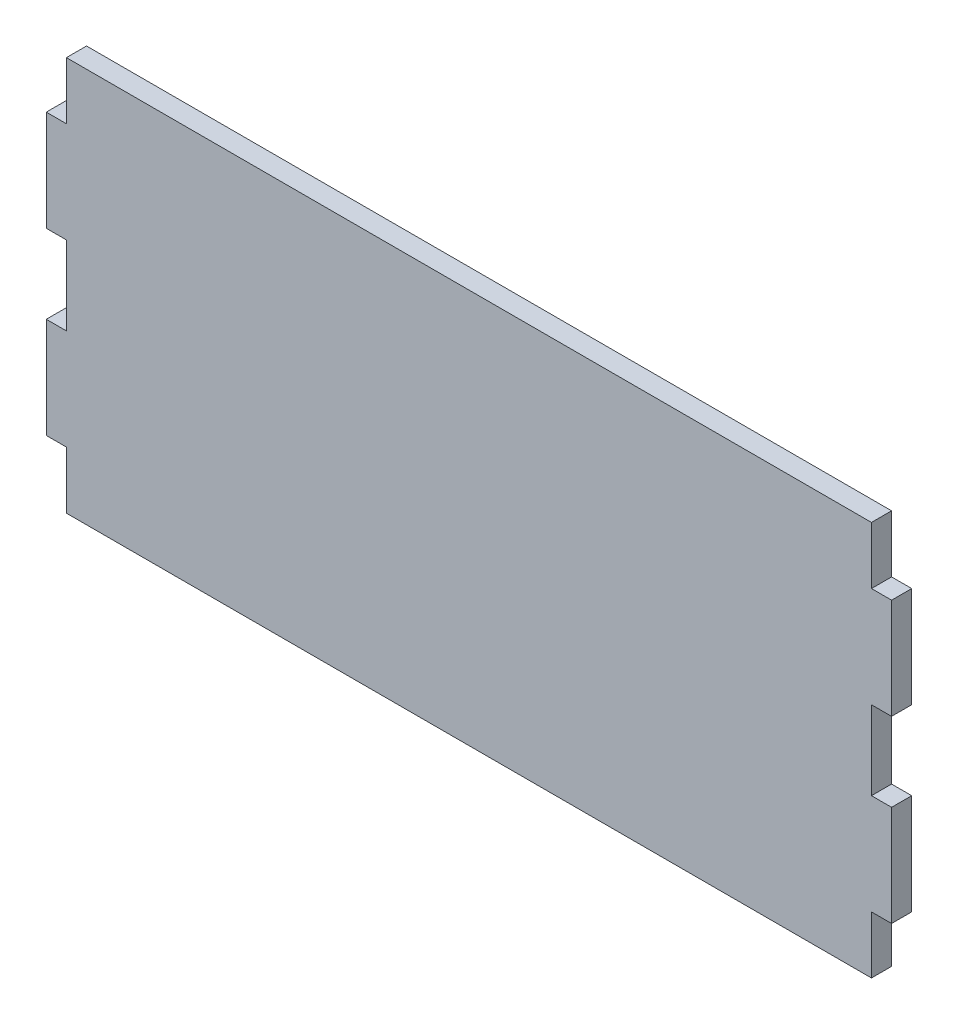
ISO-10303-21;
HEADER;
FILE_DESCRIPTION(('STEP AP214'),'2;1');
FILE_NAME('part.step','',(''),(''),'','','');
FILE_SCHEMA(('AUTOMOTIVE_DESIGN { 1 0 10303 214 1 1 1 1 }'));
ENDSEC;
DATA;
#1=APPLICATION_CONTEXT('core data for automotive mechanical design processes');
#2=APPLICATION_PROTOCOL_DEFINITION('international standard','automotive_design',2000,#1);
#3=PRODUCT_CONTEXT('',#1,'mechanical');
#4=PRODUCT('Part','Part','',(#3));
#5=PRODUCT_RELATED_PRODUCT_CATEGORY('part','',(#4));
#6=PRODUCT_DEFINITION_FORMATION('','',#4);
#7=PRODUCT_DEFINITION_CONTEXT('part definition',#1,'design');
#8=PRODUCT_DEFINITION('design','',#6,#7);
#9=PRODUCT_DEFINITION_SHAPE('','',#8);
#10=(LENGTH_UNIT() NAMED_UNIT(*) SI_UNIT(.MILLI.,.METRE.));
#11=(NAMED_UNIT(*) PLANE_ANGLE_UNIT() SI_UNIT($,.RADIAN.));
#12=(NAMED_UNIT(*) SI_UNIT($,.STERADIAN.) SOLID_ANGLE_UNIT());
#13=UNCERTAINTY_MEASURE_WITH_UNIT(LENGTH_MEASURE(1.E-05),#10,'distance_accuracy_value','');
#14=(GEOMETRIC_REPRESENTATION_CONTEXT(3) GLOBAL_UNCERTAINTY_ASSIGNED_CONTEXT((#13)) GLOBAL_UNIT_ASSIGNED_CONTEXT((#10,
#11,#12)) REPRESENTATION_CONTEXT('',''));
#15=CARTESIAN_POINT('',(0.,0.,0.));
#16=DIRECTION('',(0.,0.,1.));
#17=DIRECTION('',(1.,0.,0.));
#18=AXIS2_PLACEMENT_3D('',#15,#16,#17);
#19=CARTESIAN_POINT('',(0.,0.,15.));
#20=DIRECTION('',(1.,0.,0.));
#21=DIRECTION('',(0.,0.,-1.));
#22=AXIS2_PLACEMENT_3D('',#19,#20,#21);
#23=PLANE('',#22);
#24=DIRECTION('',(0.,-1.,0.));
#25=VECTOR('',#24,1.);
#26=CARTESIAN_POINT('',(0.,0.,0.));
#27=LINE('',#26,#25);
#28=CARTESIAN_POINT('',(0.,42.675,0.));
#29=VERTEX_POINT('',#28);
#30=CARTESIAN_POINT('',(0.,0.,0.));
#31=VERTEX_POINT('',#30);
#32=EDGE_CURVE('E204',#29,#31,#27,.T.);
#33=ORIENTED_EDGE('',*,*,#32,.T.);
#34=DIRECTION('',(0.,0.,-1.));
#35=VECTOR('',#34,1.);
#36=CARTESIAN_POINT('',(0.,0.,15.));
#37=LINE('',#36,#35);
#38=CARTESIAN_POINT('',(0.,0.,15.));
#39=VERTEX_POINT('',#38);
#40=EDGE_CURVE('E11',#39,#31,#37,.T.);
#41=ORIENTED_EDGE('',*,*,#40,.F.);
#42=DIRECTION('',(0.,-1.,0.));
#43=VECTOR('',#42,1.);
#44=CARTESIAN_POINT('',(0.,0.,15.));
#45=LINE('',#44,#43);
#46=CARTESIAN_POINT('',(0.,42.675,15.));
#47=VERTEX_POINT('',#46);
#48=EDGE_CURVE('E242',#47,#39,#45,.T.);
#49=ORIENTED_EDGE('',*,*,#48,.F.);
#50=DIRECTION('',(0.,0.,-1.));
#51=VECTOR('',#50,1.);
#52=CARTESIAN_POINT('',(0.,42.675,15.));
#53=LINE('',#52,#51);
#54=EDGE_CURVE('E200',#47,#29,#53,.T.);
#55=ORIENTED_EDGE('',*,*,#54,.T.);
#56=EDGE_LOOP('',(#33,#41,#49,#55));
#57=FACE_BOUND('',#56,.T.);
#58=ADVANCED_FACE('F36',(#57),#23,.F.);
#59=CARTESIAN_POINT('',(0.,0.,15.));
#60=DIRECTION('',(0.,1.,0.));
#61=DIRECTION('',(0.,0.,1.));
#62=AXIS2_PLACEMENT_3D('',#59,#60,#61);
#63=PLANE('',#62);
#64=DIRECTION('',(1.,0.,0.));
#65=VECTOR('',#64,1.);
#66=CARTESIAN_POINT('',(0.,0.,0.));
#67=LINE('',#66,#65);
#68=CARTESIAN_POINT('',(600.,0.,0.));
#69=VERTEX_POINT('',#68);
#70=EDGE_CURVE('E207',#31,#69,#67,.T.);
#71=ORIENTED_EDGE('',*,*,#70,.T.);
#72=DIRECTION('',(0.,0.,-1.));
#73=VECTOR('',#72,1.);
#74=CARTESIAN_POINT('',(600.,0.,15.));
#75=LINE('',#74,#73);
#76=CARTESIAN_POINT('',(600.,0.,15.));
#77=VERTEX_POINT('',#76);
#78=EDGE_CURVE('E44',#77,#69,#75,.T.);
#79=ORIENTED_EDGE('',*,*,#78,.F.);
#80=DIRECTION('',(1.,0.,0.));
#81=VECTOR('',#80,1.);
#82=CARTESIAN_POINT('',(0.,0.,15.));
#83=LINE('',#82,#81);
#84=EDGE_CURVE('E131',#39,#77,#83,.T.);
#85=ORIENTED_EDGE('',*,*,#84,.F.);
#86=ORIENTED_EDGE('',*,*,#40,.T.);
#87=EDGE_LOOP('',(#71,#79,#85,#86));
#88=FACE_BOUND('',#87,.T.);
#89=ADVANCED_FACE('F360',(#88),#63,.F.);
#90=CARTESIAN_POINT('',(600.,0.,15.));
#91=DIRECTION('',(-1.,0.,0.));
#92=DIRECTION('',(0.,0.,1.));
#93=AXIS2_PLACEMENT_3D('',#90,#91,#92);
#94=PLANE('',#93);
#95=DIRECTION('',(0.,1.,0.));
#96=VECTOR('',#95,1.);
#97=CARTESIAN_POINT('',(600.,0.,0.));
#98=LINE('',#97,#96);
#99=CARTESIAN_POINT('',(600.,42.675,0.));
#100=VERTEX_POINT('',#99);
#101=EDGE_CURVE('E209',#69,#100,#98,.T.);
#102=ORIENTED_EDGE('',*,*,#101,.T.);
#103=DIRECTION('',(0.,0.,-1.));
#104=VECTOR('',#103,1.);
#105=CARTESIAN_POINT('',(600.,42.675,15.));
#106=LINE('',#105,#104);
#107=CARTESIAN_POINT('',(600.,42.675,15.));
#108=VERTEX_POINT('',#107);
#109=EDGE_CURVE('E285',#108,#100,#106,.T.);
#110=ORIENTED_EDGE('',*,*,#109,.F.);
#111=DIRECTION('',(0.,1.,0.));
#112=VECTOR('',#111,1.);
#113=CARTESIAN_POINT('',(600.,0.,15.));
#114=LINE('',#113,#112);
#115=EDGE_CURVE('E293',#77,#108,#114,.T.);
#116=ORIENTED_EDGE('',*,*,#115,.F.);
#117=ORIENTED_EDGE('',*,*,#78,.T.);
#118=EDGE_LOOP('',(#102,#110,#116,#117));
#119=FACE_BOUND('',#118,.T.);
#120=ADVANCED_FACE('F291',(#119),#94,.F.);
#121=CARTESIAN_POINT('',(600.,42.675,15.));
#122=DIRECTION('',(0.,1.,0.));
#123=DIRECTION('',(0.,0.,1.));
#124=AXIS2_PLACEMENT_3D('',#121,#122,#123);
#125=PLANE('',#124);
#126=DIRECTION('',(1.,0.,0.));
#127=VECTOR('',#126,1.);
#128=CARTESIAN_POINT('',(600.,42.675,0.));
#129=LINE('',#128,#127);
#130=CARTESIAN_POINT('',(615.,42.675,0.));
#131=VERTEX_POINT('',#130);
#132=EDGE_CURVE('E211',#100,#131,#129,.T.);
#133=ORIENTED_EDGE('',*,*,#132,.T.);
#134=DIRECTION('',(0.,0.,-1.));
#135=VECTOR('',#134,1.);
#136=CARTESIAN_POINT('',(615.,42.675,15.));
#137=LINE('',#136,#135);
#138=CARTESIAN_POINT('',(615.,42.675,15.));
#139=VERTEX_POINT('',#138);
#140=EDGE_CURVE('E282',#139,#131,#137,.T.);
#141=ORIENTED_EDGE('',*,*,#140,.F.);
#142=DIRECTION('',(1.,0.,0.));
#143=VECTOR('',#142,1.);
#144=CARTESIAN_POINT('',(600.,42.675,15.));
#145=LINE('',#144,#143);
#146=EDGE_CURVE('E311',#108,#139,#145,.T.);
#147=ORIENTED_EDGE('',*,*,#146,.F.);
#148=ORIENTED_EDGE('',*,*,#109,.T.);
#149=EDGE_LOOP('',(#133,#141,#147,#148));
#150=FACE_BOUND('',#149,.T.);
#151=ADVANCED_FACE('F302',(#150),#125,.F.);
#152=CARTESIAN_POINT('',(615.,42.675,15.));
#153=DIRECTION('',(-1.,0.,0.));
#154=DIRECTION('',(0.,-1.,0.));
#155=AXIS2_PLACEMENT_3D('',#152,#153,#154);
#156=PLANE('',#155);
#157=DIRECTION('',(0.,1.,0.));
#158=VECTOR('',#157,1.);
#159=CARTESIAN_POINT('',(615.,42.675,0.));
#160=LINE('',#159,#158);
#161=CARTESIAN_POINT('',(615.,117.675,0.));
#162=VERTEX_POINT('',#161);
#163=EDGE_CURVE('E213',#131,#162,#160,.T.);
#164=ORIENTED_EDGE('',*,*,#163,.T.);
#165=DIRECTION('',(0.,0.,-1.));
#166=VECTOR('',#165,1.);
#167=CARTESIAN_POINT('',(615.,117.675,15.));
#168=LINE('',#167,#166);
#169=CARTESIAN_POINT('',(615.,117.675,15.));
#170=VERTEX_POINT('',#169);
#171=EDGE_CURVE('E279',#170,#162,#168,.T.);
#172=ORIENTED_EDGE('',*,*,#171,.F.);
#173=DIRECTION('',(0.,1.,0.));
#174=VECTOR('',#173,1.);
#175=CARTESIAN_POINT('',(615.,42.675,15.));
#176=LINE('',#175,#174);
#177=EDGE_CURVE('E308',#139,#170,#176,.T.);
#178=ORIENTED_EDGE('',*,*,#177,.F.);
#179=ORIENTED_EDGE('',*,*,#140,.T.);
#180=EDGE_LOOP('',(#164,#172,#178,#179));
#181=FACE_BOUND('',#180,.T.);
#182=ADVANCED_FACE('F306',(#181),#156,.F.);
#183=CARTESIAN_POINT('',(615.,117.675,15.));
#184=DIRECTION('',(0.,-1.,0.));
#185=DIRECTION('',(0.,0.,-1.));
#186=AXIS2_PLACEMENT_3D('',#183,#184,#185);
#187=PLANE('',#186);
#188=DIRECTION('',(-1.,0.,0.));
#189=VECTOR('',#188,1.);
#190=CARTESIAN_POINT('',(615.,117.675,0.));
#191=LINE('',#190,#189);
#192=CARTESIAN_POINT('',(600.,117.675,0.));
#193=VERTEX_POINT('',#192);
#194=EDGE_CURVE('E215',#162,#193,#191,.T.);
#195=ORIENTED_EDGE('',*,*,#194,.T.);
#196=DIRECTION('',(0.,0.,-1.));
#197=VECTOR('',#196,1.);
#198=CARTESIAN_POINT('',(600.,117.675,15.));
#199=LINE('',#198,#197);
#200=CARTESIAN_POINT('',(600.,117.675,15.));
#201=VERTEX_POINT('',#200);
#202=EDGE_CURVE('E276',#201,#193,#199,.T.);
#203=ORIENTED_EDGE('',*,*,#202,.F.);
#204=DIRECTION('',(-1.,0.,0.));
#205=VECTOR('',#204,1.);
#206=CARTESIAN_POINT('',(615.,117.675,15.));
#207=LINE('',#206,#205);
#208=EDGE_CURVE('E310',#170,#201,#207,.T.);
#209=ORIENTED_EDGE('',*,*,#208,.F.);
#210=ORIENTED_EDGE('',*,*,#171,.T.);
#211=EDGE_LOOP('',(#195,#203,#209,#210));
#212=FACE_BOUND('',#211,.T.);
#213=ADVANCED_FACE('F373',(#212),#187,.F.);
#214=CARTESIAN_POINT('',(600.,117.675,15.));
#215=DIRECTION('',(-1.,0.,0.));
#216=DIRECTION('',(0.,0.,1.));
#217=AXIS2_PLACEMENT_3D('',#214,#215,#216);
#218=PLANE('',#217);
#219=DIRECTION('',(0.,1.,0.));
#220=VECTOR('',#219,1.);
#221=CARTESIAN_POINT('',(600.,117.675,0.));
#222=LINE('',#221,#220);
#223=CARTESIAN_POINT('',(600.,176.375,0.));
#224=VERTEX_POINT('',#223);
#225=EDGE_CURVE('E217',#193,#224,#222,.T.);
#226=ORIENTED_EDGE('',*,*,#225,.T.);
#227=DIRECTION('',(0.,0.,-1.));
#228=VECTOR('',#227,1.);
#229=CARTESIAN_POINT('',(600.,176.375,15.));
#230=LINE('',#229,#228);
#231=CARTESIAN_POINT('',(600.,176.375,15.));
#232=VERTEX_POINT('',#231);
#233=EDGE_CURVE('E273',#232,#224,#230,.T.);
#234=ORIENTED_EDGE('',*,*,#233,.F.);
#235=DIRECTION('',(0.,1.,0.));
#236=VECTOR('',#235,1.);
#237=CARTESIAN_POINT('',(600.,117.675,15.));
#238=LINE('',#237,#236);
#239=EDGE_CURVE('E313',#201,#232,#238,.T.);
#240=ORIENTED_EDGE('',*,*,#239,.F.);
#241=ORIENTED_EDGE('',*,*,#202,.T.);
#242=EDGE_LOOP('',(#226,#234,#240,#241));
#243=FACE_BOUND('',#242,.T.);
#244=ADVANCED_FACE('F376',(#243),#218,.F.);
#245=CARTESIAN_POINT('',(600.,176.375,15.));
#246=DIRECTION('',(0.,1.,0.));
#247=DIRECTION('',(0.,0.,1.));
#248=AXIS2_PLACEMENT_3D('',#245,#246,#247);
#249=PLANE('',#248);
#250=DIRECTION('',(1.,0.,0.));
#251=VECTOR('',#250,1.);
#252=CARTESIAN_POINT('',(600.,176.375,0.));
#253=LINE('',#252,#251);
#254=CARTESIAN_POINT('',(615.,176.375,0.));
#255=VERTEX_POINT('',#254);
#256=EDGE_CURVE('E219',#224,#255,#253,.T.);
#257=ORIENTED_EDGE('',*,*,#256,.T.);
#258=DIRECTION('',(0.,0.,-1.));
#259=VECTOR('',#258,1.);
#260=CARTESIAN_POINT('',(615.,176.375,15.));
#261=LINE('',#260,#259);
#262=CARTESIAN_POINT('',(615.,176.375,15.));
#263=VERTEX_POINT('',#262);
#264=EDGE_CURVE('E270',#263,#255,#261,.T.);
#265=ORIENTED_EDGE('',*,*,#264,.F.);
#266=DIRECTION('',(1.,0.,0.));
#267=VECTOR('',#266,1.);
#268=CARTESIAN_POINT('',(600.,176.375,15.));
#269=LINE('',#268,#267);
#270=EDGE_CURVE('E319',#232,#263,#269,.T.);
#271=ORIENTED_EDGE('',*,*,#270,.F.);
#272=ORIENTED_EDGE('',*,*,#233,.T.);
#273=EDGE_LOOP('',(#257,#265,#271,#272));
#274=FACE_BOUND('',#273,.T.);
#275=ADVANCED_FACE('F380',(#274),#249,.F.);
#276=CARTESIAN_POINT('',(615.,176.375,15.));
#277=DIRECTION('',(-1.,0.,0.));
#278=DIRECTION('',(0.,0.,1.));
#279=AXIS2_PLACEMENT_3D('',#276,#277,#278);
#280=PLANE('',#279);
#281=DIRECTION('',(0.,1.,0.));
#282=VECTOR('',#281,1.);
#283=CARTESIAN_POINT('',(615.,176.375,0.));
#284=LINE('',#283,#282);
#285=CARTESIAN_POINT('',(615.,251.375,0.));
#286=VERTEX_POINT('',#285);
#287=EDGE_CURVE('E221',#255,#286,#284,.T.);
#288=ORIENTED_EDGE('',*,*,#287,.T.);
#289=DIRECTION('',(0.,0.,-1.));
#290=VECTOR('',#289,1.);
#291=CARTESIAN_POINT('',(615.,251.375,15.));
#292=LINE('',#291,#290);
#293=CARTESIAN_POINT('',(615.,251.375,15.));
#294=VERTEX_POINT('',#293);
#295=EDGE_CURVE('E267',#294,#286,#292,.T.);
#296=ORIENTED_EDGE('',*,*,#295,.F.);
#297=DIRECTION('',(0.,1.,0.));
#298=VECTOR('',#297,1.);
#299=CARTESIAN_POINT('',(615.,176.375,15.));
#300=LINE('',#299,#298);
#301=EDGE_CURVE('E321',#263,#294,#300,.T.);
#302=ORIENTED_EDGE('',*,*,#301,.F.);
#303=ORIENTED_EDGE('',*,*,#264,.T.);
#304=EDGE_LOOP('',(#288,#296,#302,#303));
#305=FACE_BOUND('',#304,.T.);
#306=ADVANCED_FACE('F384',(#305),#280,.F.);
#307=CARTESIAN_POINT('',(615.,251.375,15.));
#308=DIRECTION('',(0.,-1.,0.));
#309=DIRECTION('',(0.,0.,-1.));
#310=AXIS2_PLACEMENT_3D('',#307,#308,#309);
#311=PLANE('',#310);
#312=DIRECTION('',(-1.,0.,0.));
#313=VECTOR('',#312,1.);
#314=CARTESIAN_POINT('',(615.,251.375,0.));
#315=LINE('',#314,#313);
#316=CARTESIAN_POINT('',(600.,251.375,0.));
#317=VERTEX_POINT('',#316);
#318=EDGE_CURVE('E223',#286,#317,#315,.T.);
#319=ORIENTED_EDGE('',*,*,#318,.T.);
#320=DIRECTION('',(0.,0.,-1.));
#321=VECTOR('',#320,1.);
#322=CARTESIAN_POINT('',(600.,251.375,15.));
#323=LINE('',#322,#321);
#324=CARTESIAN_POINT('',(600.,251.375,15.));
#325=VERTEX_POINT('',#324);
#326=EDGE_CURVE('E264',#325,#317,#323,.T.);
#327=ORIENTED_EDGE('',*,*,#326,.F.);
#328=DIRECTION('',(-1.,0.,0.));
#329=VECTOR('',#328,1.);
#330=CARTESIAN_POINT('',(615.,251.375,15.));
#331=LINE('',#330,#329);
#332=EDGE_CURVE('E323',#294,#325,#331,.T.);
#333=ORIENTED_EDGE('',*,*,#332,.F.);
#334=ORIENTED_EDGE('',*,*,#295,.T.);
#335=EDGE_LOOP('',(#319,#327,#333,#334));
#336=FACE_BOUND('',#335,.T.);
#337=ADVANCED_FACE('F388',(#336),#311,.F.);
#338=CARTESIAN_POINT('',(600.,251.375,15.));
#339=DIRECTION('',(-1.,0.,0.));
#340=DIRECTION('',(0.,0.,1.));
#341=AXIS2_PLACEMENT_3D('',#338,#339,#340);
#342=PLANE('',#341);
#343=DIRECTION('',(0.,1.,0.));
#344=VECTOR('',#343,1.);
#345=CARTESIAN_POINT('',(600.,251.375,0.));
#346=LINE('',#345,#344);
#347=CARTESIAN_POINT('',(600.,294.05,0.));
#348=VERTEX_POINT('',#347);
#349=EDGE_CURVE('E225',#317,#348,#346,.T.);
#350=ORIENTED_EDGE('',*,*,#349,.T.);
#351=DIRECTION('',(0.,0.,-1.));
#352=VECTOR('',#351,1.);
#353=CARTESIAN_POINT('',(600.,294.05,15.));
#354=LINE('',#353,#352);
#355=CARTESIAN_POINT('',(600.,294.05,15.));
#356=VERTEX_POINT('',#355);
#357=EDGE_CURVE('E261',#356,#348,#354,.T.);
#358=ORIENTED_EDGE('',*,*,#357,.F.);
#359=DIRECTION('',(0.,1.,0.));
#360=VECTOR('',#359,1.);
#361=CARTESIAN_POINT('',(600.,251.375,15.));
#362=LINE('',#361,#360);
#363=EDGE_CURVE('E325',#325,#356,#362,.T.);
#364=ORIENTED_EDGE('',*,*,#363,.F.);
#365=ORIENTED_EDGE('',*,*,#326,.T.);
#366=EDGE_LOOP('',(#350,#358,#364,#365));
#367=FACE_BOUND('',#366,.T.);
#368=ADVANCED_FACE('F392',(#367),#342,.F.);
#369=CARTESIAN_POINT('',(600.,294.05,15.));
#370=DIRECTION('',(0.,-1.,0.));
#371=DIRECTION('',(0.,0.,-1.));
#372=AXIS2_PLACEMENT_3D('',#369,#370,#371);
#373=PLANE('',#372);
#374=DIRECTION('',(-1.,0.,0.));
#375=VECTOR('',#374,1.);
#376=CARTESIAN_POINT('',(600.,294.05,0.));
#377=LINE('',#376,#375);
#378=CARTESIAN_POINT('',(0.,294.05,0.));
#379=VERTEX_POINT('',#378);
#380=EDGE_CURVE('E227',#348,#379,#377,.T.);
#381=ORIENTED_EDGE('',*,*,#380,.T.);
#382=DIRECTION('',(0.,0.,-1.));
#383=VECTOR('',#382,1.);
#384=CARTESIAN_POINT('',(0.,294.05,15.));
#385=LINE('',#384,#383);
#386=CARTESIAN_POINT('',(0.,294.05,15.));
#387=VERTEX_POINT('',#386);
#388=EDGE_CURVE('E258',#387,#379,#385,.T.);
#389=ORIENTED_EDGE('',*,*,#388,.F.);
#390=DIRECTION('',(-1.,0.,0.));
#391=VECTOR('',#390,1.);
#392=CARTESIAN_POINT('',(600.,294.05,15.));
#393=LINE('',#392,#391);
#394=EDGE_CURVE('E327',#356,#387,#393,.T.);
#395=ORIENTED_EDGE('',*,*,#394,.F.);
#396=ORIENTED_EDGE('',*,*,#357,.T.);
#397=EDGE_LOOP('',(#381,#389,#395,#396));
#398=FACE_BOUND('',#397,.T.);
#399=ADVANCED_FACE('F396',(#398),#373,.F.);
#400=CARTESIAN_POINT('',(0.,251.375,15.));
#401=DIRECTION('',(1.,0.,0.));
#402=DIRECTION('',(0.,0.,-1.));
#403=AXIS2_PLACEMENT_3D('',#400,#401,#402);
#404=PLANE('',#403);
#405=DIRECTION('',(0.,-1.,0.));
#406=VECTOR('',#405,1.);
#407=CARTESIAN_POINT('',(0.,251.375,0.));
#408=LINE('',#407,#406);
#409=CARTESIAN_POINT('',(0.,251.375,0.));
#410=VERTEX_POINT('',#409);
#411=EDGE_CURVE('E229',#379,#410,#408,.T.);
#412=ORIENTED_EDGE('',*,*,#411,.T.);
#413=DIRECTION('',(0.,0.,-1.));
#414=VECTOR('',#413,1.);
#415=CARTESIAN_POINT('',(0.,251.375,15.));
#416=LINE('',#415,#414);
#417=CARTESIAN_POINT('',(0.,251.375,15.));
#418=VERTEX_POINT('',#417);
#419=EDGE_CURVE('E255',#418,#410,#416,.T.);
#420=ORIENTED_EDGE('',*,*,#419,.F.);
#421=DIRECTION('',(0.,-1.,0.));
#422=VECTOR('',#421,1.);
#423=CARTESIAN_POINT('',(0.,251.375,15.));
#424=LINE('',#423,#422);
#425=EDGE_CURVE('E329',#387,#418,#424,.T.);
#426=ORIENTED_EDGE('',*,*,#425,.F.);
#427=ORIENTED_EDGE('',*,*,#388,.T.);
#428=EDGE_LOOP('',(#412,#420,#426,#427));
#429=FACE_BOUND('',#428,.T.);
#430=ADVANCED_FACE('F400',(#429),#404,.F.);
#431=CARTESIAN_POINT('',(-14.9999999999999,251.375,15.));
#432=DIRECTION('',(0.,-1.,0.));
#433=DIRECTION('',(0.,0.,-1.));
#434=AXIS2_PLACEMENT_3D('',#431,#432,#433);
#435=PLANE('',#434);
#436=DIRECTION('',(-1.,0.,0.));
#437=VECTOR('',#436,1.);
#438=CARTESIAN_POINT('',(-14.9999999999999,251.375,0.));
#439=LINE('',#438,#437);
#440=CARTESIAN_POINT('',(-14.9999999999999,251.375,0.));
#441=VERTEX_POINT('',#440);
#442=EDGE_CURVE('E231',#410,#441,#439,.T.);
#443=ORIENTED_EDGE('',*,*,#442,.T.);
#444=DIRECTION('',(0.,0.,-1.));
#445=VECTOR('',#444,1.);
#446=CARTESIAN_POINT('',(-14.9999999999999,251.375,15.));
#447=LINE('',#446,#445);
#448=CARTESIAN_POINT('',(-14.9999999999999,251.375,15.));
#449=VERTEX_POINT('',#448);
#450=EDGE_CURVE('E252',#449,#441,#447,.T.);
#451=ORIENTED_EDGE('',*,*,#450,.F.);
#452=DIRECTION('',(-1.,0.,0.));
#453=VECTOR('',#452,1.);
#454=CARTESIAN_POINT('',(-14.9999999999999,251.375,15.));
#455=LINE('',#454,#453);
#456=EDGE_CURVE('E331',#418,#449,#455,.T.);
#457=ORIENTED_EDGE('',*,*,#456,.F.);
#458=ORIENTED_EDGE('',*,*,#419,.T.);
#459=EDGE_LOOP('',(#443,#451,#457,#458));
#460=FACE_BOUND('',#459,.T.);
#461=ADVANCED_FACE('F404',(#460),#435,.F.);
#462=CARTESIAN_POINT('',(-14.9999999999999,176.375,15.));
#463=DIRECTION('',(1.,0.,0.));
#464=DIRECTION('',(0.,0.,-1.));
#465=AXIS2_PLACEMENT_3D('',#462,#463,#464);
#466=PLANE('',#465);
#467=DIRECTION('',(0.,-1.,0.));
#468=VECTOR('',#467,1.);
#469=CARTESIAN_POINT('',(-14.9999999999999,176.375,0.));
#470=LINE('',#469,#468);
#471=CARTESIAN_POINT('',(-14.9999999999999,176.375,0.));
#472=VERTEX_POINT('',#471);
#473=EDGE_CURVE('E233',#441,#472,#470,.T.);
#474=ORIENTED_EDGE('',*,*,#473,.T.);
#475=DIRECTION('',(0.,0.,-1.));
#476=VECTOR('',#475,1.);
#477=CARTESIAN_POINT('',(-14.9999999999999,176.375,15.));
#478=LINE('',#477,#476);
#479=CARTESIAN_POINT('',(-14.9999999999999,176.375,15.));
#480=VERTEX_POINT('',#479);
#481=EDGE_CURVE('E249',#480,#472,#478,.T.);
#482=ORIENTED_EDGE('',*,*,#481,.F.);
#483=DIRECTION('',(0.,-1.,0.));
#484=VECTOR('',#483,1.);
#485=CARTESIAN_POINT('',(-14.9999999999999,176.375,15.));
#486=LINE('',#485,#484);
#487=EDGE_CURVE('E333',#449,#480,#486,.T.);
#488=ORIENTED_EDGE('',*,*,#487,.F.);
#489=ORIENTED_EDGE('',*,*,#450,.T.);
#490=EDGE_LOOP('',(#474,#482,#488,#489));
#491=FACE_BOUND('',#490,.T.);
#492=ADVANCED_FACE('F408',(#491),#466,.F.);
#493=CARTESIAN_POINT('',(0.,176.375,15.));
#494=DIRECTION('',(0.,1.,0.));
#495=DIRECTION('',(0.,0.,1.));
#496=AXIS2_PLACEMENT_3D('',#493,#494,#495);
#497=PLANE('',#496);
#498=DIRECTION('',(1.,0.,0.));
#499=VECTOR('',#498,1.);
#500=CARTESIAN_POINT('',(0.,176.375,0.));
#501=LINE('',#500,#499);
#502=CARTESIAN_POINT('',(0.,176.375,0.));
#503=VERTEX_POINT('',#502);
#504=EDGE_CURVE('E235',#472,#503,#501,.T.);
#505=ORIENTED_EDGE('',*,*,#504,.T.);
#506=DIRECTION('',(0.,0.,-1.));
#507=VECTOR('',#506,1.);
#508=CARTESIAN_POINT('',(0.,176.375,15.));
#509=LINE('',#508,#507);
#510=CARTESIAN_POINT('',(0.,176.375,15.));
#511=VERTEX_POINT('',#510);
#512=EDGE_CURVE('E246',#511,#503,#509,.T.);
#513=ORIENTED_EDGE('',*,*,#512,.F.);
#514=DIRECTION('',(1.,0.,0.));
#515=VECTOR('',#514,1.);
#516=CARTESIAN_POINT('',(0.,176.375,15.));
#517=LINE('',#516,#515);
#518=EDGE_CURVE('E335',#480,#511,#517,.T.);
#519=ORIENTED_EDGE('',*,*,#518,.F.);
#520=ORIENTED_EDGE('',*,*,#481,.T.);
#521=EDGE_LOOP('',(#505,#513,#519,#520));
#522=FACE_BOUND('',#521,.T.);
#523=ADVANCED_FACE('F341',(#522),#497,.F.);
#524=CARTESIAN_POINT('',(0.,117.675,15.));
#525=DIRECTION('',(1.,0.,0.));
#526=DIRECTION('',(0.,0.,-1.));
#527=AXIS2_PLACEMENT_3D('',#524,#525,#526);
#528=PLANE('',#527);
#529=DIRECTION('',(0.,-1.,0.));
#530=VECTOR('',#529,1.);
#531=CARTESIAN_POINT('',(0.,117.675,0.));
#532=LINE('',#531,#530);
#533=CARTESIAN_POINT('',(0.,117.675,0.));
#534=VERTEX_POINT('',#533);
#535=EDGE_CURVE('E237',#503,#534,#532,.T.);
#536=ORIENTED_EDGE('',*,*,#535,.T.);
#537=DIRECTION('',(0.,0.,-1.));
#538=VECTOR('',#537,1.);
#539=CARTESIAN_POINT('',(0.,117.675,15.));
#540=LINE('',#539,#538);
#541=CARTESIAN_POINT('',(0.,117.675,15.));
#542=VERTEX_POINT('',#541);
#543=EDGE_CURVE('E195',#542,#534,#540,.T.);
#544=ORIENTED_EDGE('',*,*,#543,.F.);
#545=DIRECTION('',(0.,-1.,0.));
#546=VECTOR('',#545,1.);
#547=CARTESIAN_POINT('',(0.,117.675,15.));
#548=LINE('',#547,#546);
#549=EDGE_CURVE('E186',#511,#542,#548,.T.);
#550=ORIENTED_EDGE('',*,*,#549,.F.);
#551=ORIENTED_EDGE('',*,*,#512,.T.);
#552=EDGE_LOOP('',(#536,#544,#550,#551));
#553=FACE_BOUND('',#552,.T.);
#554=ADVANCED_FACE('F345',(#553),#528,.F.);
#555=CARTESIAN_POINT('',(-14.9999999999999,117.675,15.));
#556=DIRECTION('',(0.,-1.,0.));
#557=DIRECTION('',(0.,0.,-1.));
#558=AXIS2_PLACEMENT_3D('',#555,#556,#557);
#559=PLANE('',#558);
#560=DIRECTION('',(-1.,0.,0.));
#561=VECTOR('',#560,1.);
#562=CARTESIAN_POINT('',(-14.9999999999999,117.675,0.));
#563=LINE('',#562,#561);
#564=CARTESIAN_POINT('',(-14.9999999999999,117.675,0.));
#565=VERTEX_POINT('',#564);
#566=EDGE_CURVE('E194',#534,#565,#563,.T.);
#567=ORIENTED_EDGE('',*,*,#566,.T.);
#568=DIRECTION('',(0.,0.,-1.));
#569=VECTOR('',#568,1.);
#570=CARTESIAN_POINT('',(-14.9999999999999,117.675,15.));
#571=LINE('',#570,#569);
#572=CARTESIAN_POINT('',(-14.9999999999999,117.675,15.));
#573=VERTEX_POINT('',#572);
#574=EDGE_CURVE('E191',#573,#565,#571,.T.);
#575=ORIENTED_EDGE('',*,*,#574,.F.);
#576=DIRECTION('',(-1.,0.,0.));
#577=VECTOR('',#576,1.);
#578=CARTESIAN_POINT('',(-14.9999999999999,117.675,15.));
#579=LINE('',#578,#577);
#580=EDGE_CURVE('E180',#542,#573,#579,.T.);
#581=ORIENTED_EDGE('',*,*,#580,.F.);
#582=ORIENTED_EDGE('',*,*,#543,.T.);
#583=EDGE_LOOP('',(#567,#575,#581,#582));
#584=FACE_BOUND('',#583,.T.);
#585=ADVANCED_FACE('F192',(#584),#559,.F.);
#586=CARTESIAN_POINT('',(-15.,42.675,15.));
#587=DIRECTION('',(1.,0.,0.));
#588=DIRECTION('',(0.,1.,0.));
#589=AXIS2_PLACEMENT_3D('',#586,#587,#588);
#590=PLANE('',#589);
#591=DIRECTION('',(0.,-1.,0.));
#592=VECTOR('',#591,1.);
#593=CARTESIAN_POINT('',(-15.,42.675,0.));
#594=LINE('',#593,#592);
#595=CARTESIAN_POINT('',(-15.,42.675,0.));
#596=VERTEX_POINT('',#595);
#597=EDGE_CURVE('E117',#565,#596,#594,.T.);
#598=ORIENTED_EDGE('',*,*,#597,.T.);
#599=DIRECTION('',(0.,0.,-1.));
#600=VECTOR('',#599,1.);
#601=CARTESIAN_POINT('',(-15.,42.675,15.));
#602=LINE('',#601,#600);
#603=CARTESIAN_POINT('',(-15.,42.675,15.));
#604=VERTEX_POINT('',#603);
#605=EDGE_CURVE('E196',#604,#596,#602,.T.);
#606=ORIENTED_EDGE('',*,*,#605,.F.);
#607=DIRECTION('',(0.,-1.,0.));
#608=VECTOR('',#607,1.);
#609=CARTESIAN_POINT('',(-15.,42.675,15.));
#610=LINE('',#609,#608);
#611=EDGE_CURVE('E184',#573,#604,#610,.T.);
#612=ORIENTED_EDGE('',*,*,#611,.F.);
#613=ORIENTED_EDGE('',*,*,#574,.T.);
#614=EDGE_LOOP('',(#598,#606,#612,#613));
#615=FACE_BOUND('',#614,.T.);
#616=ADVANCED_FACE('F198',(#615),#590,.F.);
#617=CARTESIAN_POINT('',(0.,42.675,15.));
#618=DIRECTION('',(0.,1.,0.));
#619=DIRECTION('',(0.,0.,1.));
#620=AXIS2_PLACEMENT_3D('',#617,#618,#619);
#621=PLANE('',#620);
#622=DIRECTION('',(1.,0.,0.));
#623=VECTOR('',#622,1.);
#624=CARTESIAN_POINT('',(0.,42.675,0.));
#625=LINE('',#624,#623);
#626=EDGE_CURVE('E123',#596,#29,#625,.T.);
#627=ORIENTED_EDGE('',*,*,#626,.T.);
#628=ORIENTED_EDGE('',*,*,#54,.F.);
#629=DIRECTION('',(1.,0.,0.));
#630=VECTOR('',#629,1.);
#631=CARTESIAN_POINT('',(0.,42.675,15.));
#632=LINE('',#631,#630);
#633=EDGE_CURVE('E52',#604,#47,#632,.T.);
#634=ORIENTED_EDGE('',*,*,#633,.F.);
#635=ORIENTED_EDGE('',*,*,#605,.T.);
#636=EDGE_LOOP('',(#627,#628,#634,#635));
#637=FACE_BOUND('',#636,.T.);
#638=ADVANCED_FACE('F349',(#637),#621,.F.);
#639=CARTESIAN_POINT('',(0.,0.,15.));
#640=DIRECTION('',(0.,0.,1.));
#641=DIRECTION('',(1.,0.,0.));
#642=AXIS2_PLACEMENT_3D('',#639,#640,#641);
#643=PLANE('',#642);
#644=ORIENTED_EDGE('',*,*,#48,.T.);
#645=ORIENTED_EDGE('',*,*,#84,.T.);
#646=ORIENTED_EDGE('',*,*,#115,.T.);
#647=ORIENTED_EDGE('',*,*,#146,.T.);
#648=ORIENTED_EDGE('',*,*,#177,.T.);
#649=ORIENTED_EDGE('',*,*,#208,.T.);
#650=ORIENTED_EDGE('',*,*,#239,.T.);
#651=ORIENTED_EDGE('',*,*,#270,.T.);
#652=ORIENTED_EDGE('',*,*,#301,.T.);
#653=ORIENTED_EDGE('',*,*,#332,.T.);
#654=ORIENTED_EDGE('',*,*,#363,.T.);
#655=ORIENTED_EDGE('',*,*,#394,.T.);
#656=ORIENTED_EDGE('',*,*,#425,.T.);
#657=ORIENTED_EDGE('',*,*,#456,.T.);
#658=ORIENTED_EDGE('',*,*,#487,.T.);
#659=ORIENTED_EDGE('',*,*,#518,.T.);
#660=ORIENTED_EDGE('',*,*,#549,.T.);
#661=ORIENTED_EDGE('',*,*,#580,.T.);
#662=ORIENTED_EDGE('',*,*,#611,.T.);
#663=ORIENTED_EDGE('',*,*,#633,.T.);
#664=EDGE_LOOP('',(#644,#645,#646,#647,#648,#649,#650,#651,#652,#653,#654,#655,#656,#657,#658,
#659,#660,#661,#662,#663));
#665=FACE_BOUND('',#664,.T.);
#666=ADVANCED_FACE('F182',(#665),#643,.T.);
#667=CARTESIAN_POINT('',(0.,0.,0.));
#668=DIRECTION('',(0.,0.,1.));
#669=DIRECTION('',(1.,0.,0.));
#670=AXIS2_PLACEMENT_3D('',#667,#668,#669);
#671=PLANE('',#670);
#672=ORIENTED_EDGE('',*,*,#32,.F.);
#673=ORIENTED_EDGE('',*,*,#626,.F.);
#674=ORIENTED_EDGE('',*,*,#597,.F.);
#675=ORIENTED_EDGE('',*,*,#566,.F.);
#676=ORIENTED_EDGE('',*,*,#535,.F.);
#677=ORIENTED_EDGE('',*,*,#504,.F.);
#678=ORIENTED_EDGE('',*,*,#473,.F.);
#679=ORIENTED_EDGE('',*,*,#442,.F.);
#680=ORIENTED_EDGE('',*,*,#411,.F.);
#681=ORIENTED_EDGE('',*,*,#380,.F.);
#682=ORIENTED_EDGE('',*,*,#349,.F.);
#683=ORIENTED_EDGE('',*,*,#318,.F.);
#684=ORIENTED_EDGE('',*,*,#287,.F.);
#685=ORIENTED_EDGE('',*,*,#256,.F.);
#686=ORIENTED_EDGE('',*,*,#225,.F.);
#687=ORIENTED_EDGE('',*,*,#194,.F.);
#688=ORIENTED_EDGE('',*,*,#163,.F.);
#689=ORIENTED_EDGE('',*,*,#132,.F.);
#690=ORIENTED_EDGE('',*,*,#101,.F.);
#691=ORIENTED_EDGE('',*,*,#70,.F.);
#692=EDGE_LOOP('',(#672,#673,#674,#675,#676,#677,#678,#679,#680,#681,#682,#683,#684,#685,#686,
#687,#688,#689,#690,#691));
#693=FACE_BOUND('',#692,.T.);
#694=ADVANCED_FACE('F297',(#693),#671,.F.);
#695=CLOSED_SHELL('',(#58,#89,#120,#151,#182,#213,#244,#275,#306,#337,#368,#399,#430,#461,#492,
#523,#554,#585,#616,#638,#666,#694));
#696=MANIFOLD_SOLID_BREP('B2',#695);
#697=ADVANCED_BREP_SHAPE_REPRESENTATION('',(#18,#696),#14);
#698=SHAPE_DEFINITION_REPRESENTATION(#9,#697);
ENDSEC;
END-ISO-10303-21;
